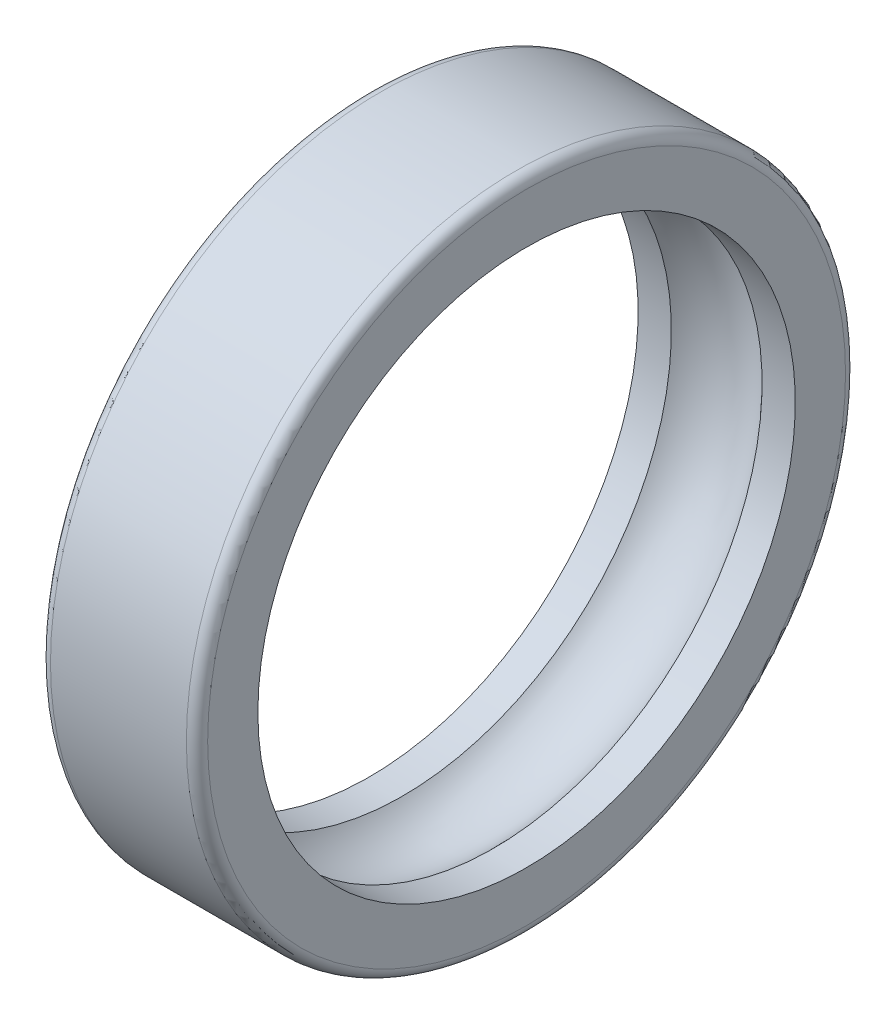
ISO-10303-21;
HEADER;
FILE_DESCRIPTION(('STEP AP214'),'2;1');
FILE_NAME('part.step','',(''),(''),'','','');
FILE_SCHEMA(('AUTOMOTIVE_DESIGN { 1 0 10303 214 1 1 1 1 }'));
ENDSEC;
DATA;
#1=APPLICATION_CONTEXT('core data for automotive mechanical design processes');
#2=APPLICATION_PROTOCOL_DEFINITION('international standard','automotive_design',2000,#1);
#3=PRODUCT_CONTEXT('',#1,'mechanical');
#4=PRODUCT('Part','Part','',(#3));
#5=PRODUCT_RELATED_PRODUCT_CATEGORY('part','',(#4));
#6=PRODUCT_DEFINITION_FORMATION('','',#4);
#7=PRODUCT_DEFINITION_CONTEXT('part definition',#1,'design');
#8=PRODUCT_DEFINITION('design','',#6,#7);
#9=PRODUCT_DEFINITION_SHAPE('','',#8);
#10=(LENGTH_UNIT() NAMED_UNIT(*) SI_UNIT(.MILLI.,.METRE.));
#11=(NAMED_UNIT(*) PLANE_ANGLE_UNIT() SI_UNIT($,.RADIAN.));
#12=(NAMED_UNIT(*) SI_UNIT($,.STERADIAN.) SOLID_ANGLE_UNIT());
#13=UNCERTAINTY_MEASURE_WITH_UNIT(LENGTH_MEASURE(1.E-05),#10,'distance_accuracy_value','');
#14=(GEOMETRIC_REPRESENTATION_CONTEXT(3) GLOBAL_UNCERTAINTY_ASSIGNED_CONTEXT((#13)) GLOBAL_UNIT_ASSIGNED_CONTEXT((#10,
#11,#12)) REPRESENTATION_CONTEXT('',''));
#15=CARTESIAN_POINT('',(0.,0.,0.));
#16=DIRECTION('',(0.,0.,1.));
#17=DIRECTION('',(1.,0.,0.));
#18=AXIS2_PLACEMENT_3D('',#15,#16,#17);
#19=CARTESIAN_POINT('',(-9.39284763505145,0.,0.));
#20=DIRECTION('',(-1.,0.,0.));
#21=DIRECTION('',(0.,0.,1.));
#22=AXIS2_PLACEMENT_3D('',#19,#20,#21);
#23=CYLINDRICAL_SURFACE('',#22,53.);
#24=CARTESIAN_POINT('',(15.5,0.,0.));
#25=DIRECTION('',(-1.,0.,0.));
#26=DIRECTION('',(0.,0.,1.));
#27=AXIS2_PLACEMENT_3D('',#24,#25,#26);
#28=CIRCLE('',#27,53.);
#29=CARTESIAN_POINT('',(15.5,0.,53.));
#30=VERTEX_POINT('',#29);
#31=EDGE_CURVE('E73',#30,#30,#28,.T.);
#32=ORIENTED_EDGE('',*,*,#31,.F.);
#33=EDGE_LOOP('',(#32));
#34=FACE_BOUND('',#33,.T.);
#35=CARTESIAN_POINT('',(8.94427190999916,0.,0.));
#36=DIRECTION('',(-1.,0.,0.));
#37=DIRECTION('',(0.,0.,1.));
#38=AXIS2_PLACEMENT_3D('',#35,#36,#37);
#39=CIRCLE('',#38,53.);
#40=CARTESIAN_POINT('',(8.94427190999916,0.,53.));
#41=VERTEX_POINT('',#40);
#42=EDGE_CURVE('E61',#41,#41,#39,.T.);
#43=ORIENTED_EDGE('',*,*,#42,.T.);
#44=EDGE_LOOP('',(#43));
#45=FACE_BOUND('',#44,.T.);
#46=ADVANCED_FACE('F37',(#34,#45),#23,.F.);
#47=CARTESIAN_POINT('',(0.,0.,0.));
#48=DIRECTION('',(-1.,0.,0.));
#49=DIRECTION('',(0.,0.,1.));
#50=AXIS2_PLACEMENT_3D('',#47,#48,#49);
#51=TOROIDAL_SURFACE('',#50,45.,12.);
#52=ORIENTED_EDGE('',*,*,#42,.F.);
#53=EDGE_LOOP('',(#52));
#54=FACE_BOUND('',#53,.T.);
#55=CARTESIAN_POINT('',(-8.94427190999916,0.,0.));
#56=DIRECTION('',(-1.,0.,0.));
#57=DIRECTION('',(0.,0.,1.));
#58=AXIS2_PLACEMENT_3D('',#55,#56,#57);
#59=CIRCLE('',#58,53.);
#60=CARTESIAN_POINT('',(-8.94427190999916,0.,53.));
#61=VERTEX_POINT('',#60);
#62=EDGE_CURVE('E65',#61,#61,#59,.T.);
#63=ORIENTED_EDGE('',*,*,#62,.T.);
#64=EDGE_LOOP('',(#63));
#65=FACE_BOUND('',#64,.T.);
#66=ADVANCED_FACE('F82',(#54,#65),#51,.F.);
#67=CARTESIAN_POINT('',(-9.39284763505145,0.,0.));
#68=DIRECTION('',(-1.,0.,0.));
#69=DIRECTION('',(0.,0.,1.));
#70=AXIS2_PLACEMENT_3D('',#67,#68,#69);
#71=CYLINDRICAL_SURFACE('',#70,53.);
#72=ORIENTED_EDGE('',*,*,#62,.F.);
#73=EDGE_LOOP('',(#72));
#74=FACE_BOUND('',#73,.T.);
#75=CARTESIAN_POINT('',(-15.5,0.,0.));
#76=DIRECTION('',(-1.,0.,0.));
#77=DIRECTION('',(0.,0.,1.));
#78=AXIS2_PLACEMENT_3D('',#75,#76,#77);
#79=CIRCLE('',#78,53.);
#80=CARTESIAN_POINT('',(-15.5,0.,53.));
#81=VERTEX_POINT('',#80);
#82=EDGE_CURVE('E69',#81,#81,#79,.T.);
#83=ORIENTED_EDGE('',*,*,#82,.T.);
#84=EDGE_LOOP('',(#83));
#85=FACE_BOUND('',#84,.T.);
#86=ADVANCED_FACE('F88',(#74,#85),#71,.F.);
#87=CARTESIAN_POINT('',(-15.5,65.,0.));
#88=DIRECTION('',(1.,0.,0.));
#89=DIRECTION('',(0.,0.,-1.));
#90=AXIS2_PLACEMENT_3D('',#87,#88,#89);
#91=PLANE('',#90);
#92=CARTESIAN_POINT('',(-15.5,0.,0.));
#93=DIRECTION('',(1.,0.,0.));
#94=DIRECTION('',(0.,0.,-1.));
#95=AXIS2_PLACEMENT_3D('',#92,#93,#94);
#96=CIRCLE('',#95,62.9);
#97=CARTESIAN_POINT('',(-15.5,0.,-62.9));
#98=VERTEX_POINT('',#97);
#99=EDGE_CURVE('E10',#98,#98,#96,.F.);
#100=ORIENTED_EDGE('',*,*,#99,.T.);
#101=EDGE_LOOP('',(#100));
#102=FACE_BOUND('',#101,.T.);
#103=ORIENTED_EDGE('',*,*,#82,.F.);
#104=EDGE_LOOP('',(#103));
#105=FACE_BOUND('',#104,.T.);
#106=ADVANCED_FACE('F94',(#102,#105),#91,.F.);
#107=CARTESIAN_POINT('',(-9.39284763505145,0.,0.));
#108=DIRECTION('',(-1.,0.,0.));
#109=DIRECTION('',(0.,0.,1.));
#110=AXIS2_PLACEMENT_3D('',#107,#108,#109);
#111=CYLINDRICAL_SURFACE('',#110,65.);
#112=CARTESIAN_POINT('',(13.4,0.,0.));
#113=DIRECTION('',(-1.,0.,0.));
#114=DIRECTION('',(0.,0.,1.));
#115=AXIS2_PLACEMENT_3D('',#112,#113,#114);
#116=CIRCLE('',#115,65.);
#117=CARTESIAN_POINT('',(13.4,0.,65.));
#118=VERTEX_POINT('',#117);
#119=EDGE_CURVE('E50',#118,#118,#116,.T.);
#120=ORIENTED_EDGE('',*,*,#119,.T.);
#121=EDGE_LOOP('',(#120));
#122=FACE_BOUND('',#121,.T.);
#123=CARTESIAN_POINT('',(-13.4,0.,0.));
#124=DIRECTION('',(1.,0.,0.));
#125=DIRECTION('',(0.,0.,-1.));
#126=AXIS2_PLACEMENT_3D('',#123,#124,#125);
#127=CIRCLE('',#126,65.);
#128=CARTESIAN_POINT('',(-13.4,0.,-65.));
#129=VERTEX_POINT('',#128);
#130=EDGE_CURVE('E55',#129,#129,#127,.T.);
#131=ORIENTED_EDGE('',*,*,#130,.T.);
#132=EDGE_LOOP('',(#131));
#133=FACE_BOUND('',#132,.T.);
#134=ADVANCED_FACE('F99',(#122,#133),#111,.T.);
#135=CARTESIAN_POINT('',(15.5,65.,0.));
#136=DIRECTION('',(-1.,0.,0.));
#137=DIRECTION('',(0.,0.,1.));
#138=AXIS2_PLACEMENT_3D('',#135,#136,#137);
#139=PLANE('',#138);
#140=CARTESIAN_POINT('',(15.5,0.,0.));
#141=DIRECTION('',(-1.,0.,0.));
#142=DIRECTION('',(0.,0.,1.));
#143=AXIS2_PLACEMENT_3D('',#140,#141,#142);
#144=CIRCLE('',#143,62.9);
#145=CARTESIAN_POINT('',(15.5,0.,62.9));
#146=VERTEX_POINT('',#145);
#147=EDGE_CURVE('E45',#146,#146,#144,.F.);
#148=ORIENTED_EDGE('',*,*,#147,.T.);
#149=EDGE_LOOP('',(#148));
#150=FACE_BOUND('',#149,.T.);
#151=ORIENTED_EDGE('',*,*,#31,.T.);
#152=EDGE_LOOP('',(#151));
#153=FACE_BOUND('',#152,.T.);
#154=ADVANCED_FACE('F78',(#150,#153),#139,.F.);
#155=CARTESIAN_POINT('',(13.4,0.,0.));
#156=DIRECTION('',(-1.,0.,0.));
#157=DIRECTION('',(0.,0.,1.));
#158=AXIS2_PLACEMENT_3D('',#155,#156,#157);
#159=TOROIDAL_SURFACE('',#158,62.9,2.1);
#160=ORIENTED_EDGE('',*,*,#147,.F.);
#161=EDGE_LOOP('',(#160));
#162=FACE_BOUND('',#161,.T.);
#163=ORIENTED_EDGE('',*,*,#119,.F.);
#164=EDGE_LOOP('',(#163));
#165=FACE_BOUND('',#164,.T.);
#166=ADVANCED_FACE('F107',(#162,#165),#159,.T.);
#167=CARTESIAN_POINT('',(-13.4,0.,0.));
#168=DIRECTION('',(1.,0.,0.));
#169=DIRECTION('',(0.,0.,-1.));
#170=AXIS2_PLACEMENT_3D('',#167,#168,#169);
#171=TOROIDAL_SURFACE('',#170,62.9,2.1);
#172=ORIENTED_EDGE('',*,*,#130,.F.);
#173=EDGE_LOOP('',(#172));
#174=FACE_BOUND('',#173,.T.);
#175=ORIENTED_EDGE('',*,*,#99,.F.);
#176=EDGE_LOOP('',(#175));
#177=FACE_BOUND('',#176,.T.);
#178=ADVANCED_FACE('F39',(#174,#177),#171,.T.);
#179=CLOSED_SHELL('',(#46,#66,#86,#106,#134,#154,#166,#178));
#180=MANIFOLD_SOLID_BREP('B2',#179);
#181=ADVANCED_BREP_SHAPE_REPRESENTATION('',(#18,#180),#14);
#182=SHAPE_DEFINITION_REPRESENTATION(#9,#181);
ENDSEC;
END-ISO-10303-21;
